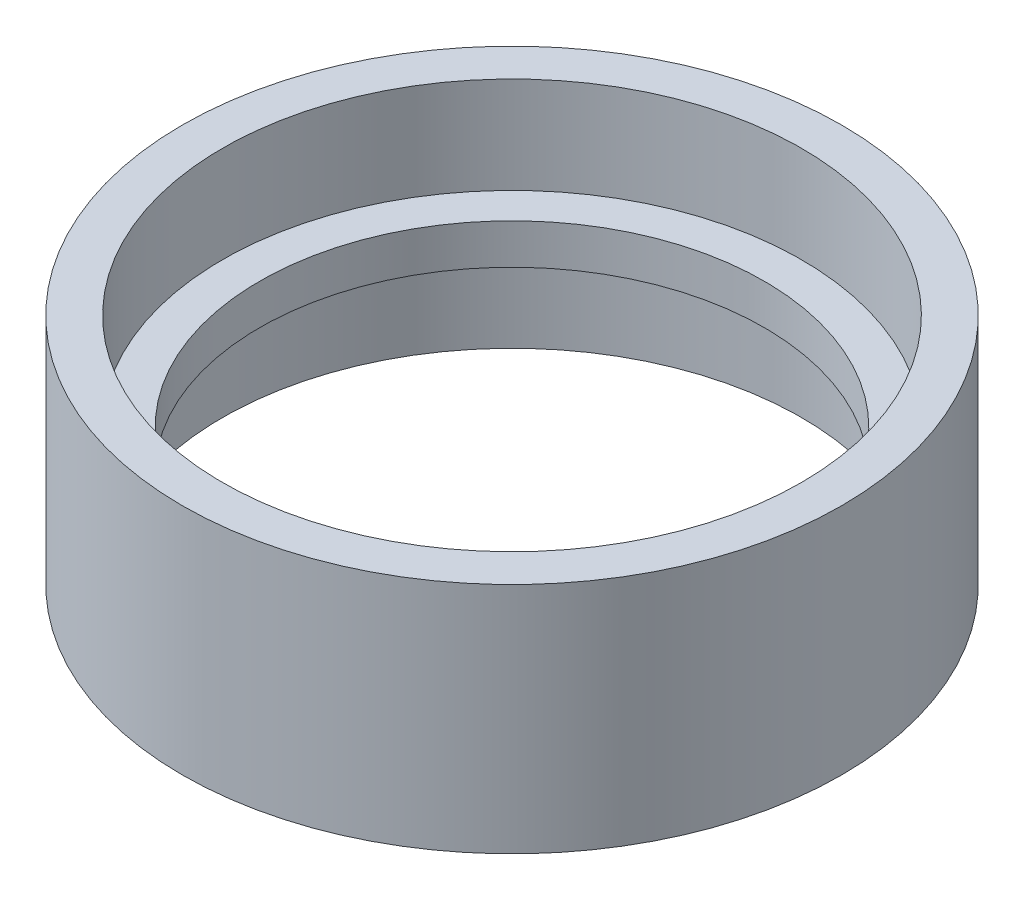
ISO-10303-21;
HEADER;
FILE_DESCRIPTION(('STEP AP214'),'2;1');
FILE_NAME('part.step','',(''),(''),'','','');
FILE_SCHEMA(('AUTOMOTIVE_DESIGN { 1 0 10303 214 1 1 1 1 }'));
ENDSEC;
DATA;
#1=APPLICATION_CONTEXT('core data for automotive mechanical design processes');
#2=APPLICATION_PROTOCOL_DEFINITION('international standard','automotive_design',2000,#1);
#3=PRODUCT_CONTEXT('',#1,'mechanical');
#4=PRODUCT('Part','Part','',(#3));
#5=PRODUCT_RELATED_PRODUCT_CATEGORY('part','',(#4));
#6=PRODUCT_DEFINITION_FORMATION('','',#4);
#7=PRODUCT_DEFINITION_CONTEXT('part definition',#1,'design');
#8=PRODUCT_DEFINITION('design','',#6,#7);
#9=PRODUCT_DEFINITION_SHAPE('','',#8);
#10=(LENGTH_UNIT() NAMED_UNIT(*) SI_UNIT(.MILLI.,.METRE.));
#11=(NAMED_UNIT(*) PLANE_ANGLE_UNIT() SI_UNIT($,.RADIAN.));
#12=(NAMED_UNIT(*) SI_UNIT($,.STERADIAN.) SOLID_ANGLE_UNIT());
#13=UNCERTAINTY_MEASURE_WITH_UNIT(LENGTH_MEASURE(1.E-05),#10,'distance_accuracy_value','');
#14=(GEOMETRIC_REPRESENTATION_CONTEXT(3) GLOBAL_UNCERTAINTY_ASSIGNED_CONTEXT((#13)) GLOBAL_UNIT_ASSIGNED_CONTEXT((#10,
#11,#12)) REPRESENTATION_CONTEXT('',''));
#15=CARTESIAN_POINT('',(0.,0.,0.));
#16=DIRECTION('',(0.,0.,1.));
#17=DIRECTION('',(1.,0.,0.));
#18=AXIS2_PLACEMENT_3D('',#15,#16,#17);
#19=CARTESIAN_POINT('',(3.49148133884313E-12,-1000.,0.));
#20=DIRECTION('',(0.,-1.,0.));
#21=DIRECTION('',(1.,0.,0.));
#22=AXIS2_PLACEMENT_3D('',#19,#20,#21);
#23=CYLINDRICAL_SURFACE('',#22,41.0000000000014);
#24=CARTESIAN_POINT('',(0.,3.00000000000011,0.));
#25=DIRECTION('',(0.,-1.,0.));
#26=DIRECTION('',(1.,0.,0.));
#27=AXIS2_PLACEMENT_3D('',#24,#25,#26);
#28=CIRCLE('',#27,41.0000000000014);
#29=CARTESIAN_POINT('',(41.0000000000014,3.00000000000026,0.));
#30=VERTEX_POINT('',#29);
#31=EDGE_CURVE('E10',#30,#30,#28,.T.);
#32=ORIENTED_EDGE('',*,*,#31,.F.);
#33=EDGE_LOOP('',(#32));
#34=FACE_BOUND('',#33,.T.);
#35=CARTESIAN_POINT('',(-1.11727402842981E-13,32.0000000000002,0.));
#36=DIRECTION('',(0.,-1.,0.));
#37=DIRECTION('',(1.,0.,0.));
#38=AXIS2_PLACEMENT_3D('',#35,#36,#37);
#39=CIRCLE('',#38,41.0000000000013);
#40=CARTESIAN_POINT('',(41.0000000000012,32.0000000000004,0.));
#41=VERTEX_POINT('',#40);
#42=EDGE_CURVE('E60',#41,#41,#39,.T.);
#43=ORIENTED_EDGE('',*,*,#42,.T.);
#44=EDGE_LOOP('',(#43));
#45=FACE_BOUND('',#44,.T.);
#46=ADVANCED_FACE('F32',(#34,#45),#23,.T.);
#47=CARTESIAN_POINT('',(-41.0000000000014,2.99999999999998,0.));
#48=DIRECTION('',(0.,1.,0.));
#49=DIRECTION('',(-1.,0.,0.));
#50=AXIS2_PLACEMENT_3D('',#47,#48,#49);
#51=PLANE('',#50);
#52=CARTESIAN_POINT('',(0.,3.00000000000011,0.));
#53=DIRECTION('',(0.,-1.,0.));
#54=DIRECTION('',(1.,0.,0.));
#55=AXIS2_PLACEMENT_3D('',#52,#53,#54);
#56=CIRCLE('',#55,36.0000000000014);
#57=CARTESIAN_POINT('',(36.0000000000014,3.00000000000024,0.));
#58=VERTEX_POINT('',#57);
#59=EDGE_CURVE('E38',#58,#58,#56,.T.);
#60=ORIENTED_EDGE('',*,*,#59,.F.);
#61=EDGE_LOOP('',(#60));
#62=FACE_BOUND('',#61,.T.);
#63=ORIENTED_EDGE('',*,*,#31,.T.);
#64=EDGE_LOOP('',(#63));
#65=FACE_BOUND('',#64,.T.);
#66=ADVANCED_FACE('F97',(#62,#65),#51,.F.);
#67=CARTESIAN_POINT('',(3.49148133884313E-12,-1000.,0.));
#68=DIRECTION('',(0.,-1.,0.));
#69=DIRECTION('',(1.,0.,0.));
#70=AXIS2_PLACEMENT_3D('',#67,#68,#69);
#71=CYLINDRICAL_SURFACE('',#70,36.0000000000014);
#72=CARTESIAN_POINT('',(0.,15.0000000000001,0.));
#73=DIRECTION('',(0.,-1.,0.));
#74=DIRECTION('',(1.,0.,0.));
#75=AXIS2_PLACEMENT_3D('',#72,#73,#74);
#76=CIRCLE('',#75,36.0000000000014);
#77=CARTESIAN_POINT('',(36.0000000000013,15.0000000000002,0.));
#78=VERTEX_POINT('',#77);
#79=EDGE_CURVE('E42',#78,#78,#76,.T.);
#80=ORIENTED_EDGE('',*,*,#79,.F.);
#81=EDGE_LOOP('',(#80));
#82=FACE_BOUND('',#81,.T.);
#83=ORIENTED_EDGE('',*,*,#59,.T.);
#84=EDGE_LOOP('',(#83));
#85=FACE_BOUND('',#84,.T.);
#86=ADVANCED_FACE('F92',(#82,#85),#71,.F.);
#87=CARTESIAN_POINT('',(-36.0000000000014,15.,0.));
#88=DIRECTION('',(0.,1.,0.));
#89=DIRECTION('',(-1.,0.,0.));
#90=AXIS2_PLACEMENT_3D('',#87,#88,#89);
#91=PLANE('',#90);
#92=CARTESIAN_POINT('',(0.,14.9999999999999,0.));
#93=DIRECTION('',(0.,-1.,0.));
#94=DIRECTION('',(1.,0.,0.));
#95=AXIS2_PLACEMENT_3D('',#92,#93,#94);
#96=CIRCLE('',#95,31.3740000000014);
#97=CARTESIAN_POINT('',(31.3740000000013,15.,0.));
#98=VERTEX_POINT('',#97);
#99=EDGE_CURVE('E46',#98,#98,#96,.T.);
#100=ORIENTED_EDGE('',*,*,#99,.F.);
#101=EDGE_LOOP('',(#100));
#102=FACE_BOUND('',#101,.T.);
#103=ORIENTED_EDGE('',*,*,#79,.T.);
#104=EDGE_LOOP('',(#103));
#105=FACE_BOUND('',#104,.T.);
#106=ADVANCED_FACE('F86',(#102,#105),#91,.F.);
#107=CARTESIAN_POINT('',(3.49148133884313E-12,-1000.,0.));
#108=DIRECTION('',(0.,-1.,0.));
#109=DIRECTION('',(1.,0.,0.));
#110=AXIS2_PLACEMENT_3D('',#107,#108,#109);
#111=CYLINDRICAL_SURFACE('',#110,31.3740000000014);
#112=CARTESIAN_POINT('',(0.,20.,0.));
#113=DIRECTION('',(0.,-1.,0.));
#114=DIRECTION('',(1.,0.,0.));
#115=AXIS2_PLACEMENT_3D('',#112,#113,#114);
#116=CIRCLE('',#115,31.3740000000013);
#117=CARTESIAN_POINT('',(31.3740000000013,20.0000000000001,0.));
#118=VERTEX_POINT('',#117);
#119=EDGE_CURVE('E51',#118,#118,#116,.T.);
#120=ORIENTED_EDGE('',*,*,#119,.F.);
#121=EDGE_LOOP('',(#120));
#122=FACE_BOUND('',#121,.T.);
#123=ORIENTED_EDGE('',*,*,#99,.T.);
#124=EDGE_LOOP('',(#123));
#125=FACE_BOUND('',#124,.T.);
#126=ADVANCED_FACE('F80',(#122,#125),#111,.F.);
#127=CARTESIAN_POINT('',(-36.0000000000014,20.,0.));
#128=DIRECTION('',(0.,-1.,0.));
#129=DIRECTION('',(1.,0.,0.));
#130=AXIS2_PLACEMENT_3D('',#127,#128,#129);
#131=PLANE('',#130);
#132=CARTESIAN_POINT('',(0.,20.0000000000002,0.));
#133=DIRECTION('',(0.,-1.,0.));
#134=DIRECTION('',(1.,0.,0.));
#135=AXIS2_PLACEMENT_3D('',#132,#133,#134);
#136=CIRCLE('',#135,36.0000000000013);
#137=CARTESIAN_POINT('',(36.0000000000013,20.0000000000004,0.));
#138=VERTEX_POINT('',#137);
#139=EDGE_CURVE('E54',#138,#138,#136,.T.);
#140=ORIENTED_EDGE('',*,*,#139,.F.);
#141=EDGE_LOOP('',(#140));
#142=FACE_BOUND('',#141,.T.);
#143=ORIENTED_EDGE('',*,*,#119,.T.);
#144=EDGE_LOOP('',(#143));
#145=FACE_BOUND('',#144,.T.);
#146=ADVANCED_FACE('F74',(#142,#145),#131,.F.);
#147=CARTESIAN_POINT('',(3.49148133884313E-12,-1000.,0.));
#148=DIRECTION('',(0.,-1.,0.));
#149=DIRECTION('',(1.,0.,0.));
#150=AXIS2_PLACEMENT_3D('',#147,#148,#149);
#151=CYLINDRICAL_SURFACE('',#150,36.0000000000013);
#152=CARTESIAN_POINT('',(-1.11727402842981E-13,32.0000000000002,0.));
#153=DIRECTION('',(0.,-1.,0.));
#154=DIRECTION('',(1.,0.,0.));
#155=AXIS2_PLACEMENT_3D('',#152,#153,#154);
#156=CIRCLE('',#155,36.0000000000013);
#157=CARTESIAN_POINT('',(36.0000000000012,32.0000000000004,0.));
#158=VERTEX_POINT('',#157);
#159=EDGE_CURVE('E57',#158,#158,#156,.T.);
#160=ORIENTED_EDGE('',*,*,#159,.F.);
#161=EDGE_LOOP('',(#160));
#162=FACE_BOUND('',#161,.T.);
#163=ORIENTED_EDGE('',*,*,#139,.T.);
#164=EDGE_LOOP('',(#163));
#165=FACE_BOUND('',#164,.T.);
#166=ADVANCED_FACE('F68',(#162,#165),#151,.F.);
#167=CARTESIAN_POINT('',(-41.0000000000014,32.,0.));
#168=DIRECTION('',(0.,-1.,0.));
#169=DIRECTION('',(1.,0.,0.));
#170=AXIS2_PLACEMENT_3D('',#167,#168,#169);
#171=PLANE('',#170);
#172=ORIENTED_EDGE('',*,*,#42,.F.);
#173=EDGE_LOOP('',(#172));
#174=FACE_BOUND('',#173,.T.);
#175=ORIENTED_EDGE('',*,*,#159,.T.);
#176=EDGE_LOOP('',(#175));
#177=FACE_BOUND('',#176,.T.);
#178=ADVANCED_FACE('F65',(#174,#177),#171,.F.);
#179=CLOSED_SHELL('',(#46,#66,#86,#106,#126,#146,#166,#178));
#180=MANIFOLD_SOLID_BREP('B2',#179);
#181=ADVANCED_BREP_SHAPE_REPRESENTATION('',(#18,#180),#14);
#182=SHAPE_DEFINITION_REPRESENTATION(#9,#181);
ENDSEC;
END-ISO-10303-21;
